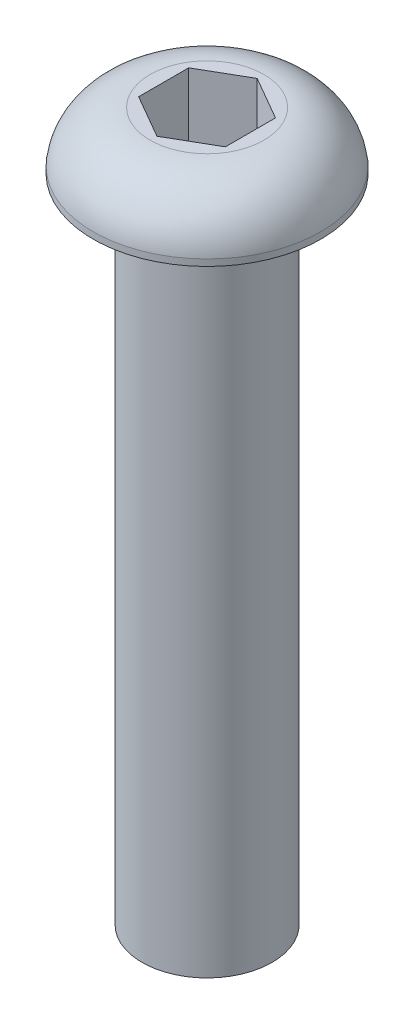
ISO-10303-21;
HEADER;
FILE_DESCRIPTION(('STEP AP214'),'2;1');
FILE_NAME('part.step','',(''),(''),'','','');
FILE_SCHEMA(('AUTOMOTIVE_DESIGN { 1 0 10303 214 1 1 1 1 }'));
ENDSEC;
DATA;
#1=APPLICATION_CONTEXT('core data for automotive mechanical design processes');
#2=APPLICATION_PROTOCOL_DEFINITION('international standard','automotive_design',2000,#1);
#3=PRODUCT_CONTEXT('',#1,'mechanical');
#4=PRODUCT('Part','Part','',(#3));
#5=PRODUCT_RELATED_PRODUCT_CATEGORY('part','',(#4));
#6=PRODUCT_DEFINITION_FORMATION('','',#4);
#7=PRODUCT_DEFINITION_CONTEXT('part definition',#1,'design');
#8=PRODUCT_DEFINITION('design','',#6,#7);
#9=PRODUCT_DEFINITION_SHAPE('','',#8);
#10=(LENGTH_UNIT() NAMED_UNIT(*) SI_UNIT(.MILLI.,.METRE.));
#11=(NAMED_UNIT(*) PLANE_ANGLE_UNIT() SI_UNIT($,.RADIAN.));
#12=(NAMED_UNIT(*) SI_UNIT($,.STERADIAN.) SOLID_ANGLE_UNIT());
#13=UNCERTAINTY_MEASURE_WITH_UNIT(LENGTH_MEASURE(1.E-05),#10,'distance_accuracy_value','');
#14=(GEOMETRIC_REPRESENTATION_CONTEXT(3) GLOBAL_UNCERTAINTY_ASSIGNED_CONTEXT((#13)) GLOBAL_UNIT_ASSIGNED_CONTEXT((#10,
#11,#12)) REPRESENTATION_CONTEXT('',''));
#15=CARTESIAN_POINT('',(0.,0.,0.));
#16=DIRECTION('',(0.,0.,1.));
#17=DIRECTION('',(1.,0.,0.));
#18=AXIS2_PLACEMENT_3D('',#15,#16,#17);
#19=CARTESIAN_POINT('',(0.,32.6420872430713,0.));
#20=DIRECTION('',(0.,1.,0.));
#21=DIRECTION('',(0.,0.,1.));
#22=AXIS2_PLACEMENT_3D('',#19,#20,#21);
#23=PLANE('',#22);
#24=DIRECTION('',(-0.866025403784438,0.,-0.5));
#25=VECTOR('',#24,1.);
#26=CARTESIAN_POINT('',(2.,32.6420872430713,-1.15470053837925));
#27=LINE('',#26,#25);
#28=CARTESIAN_POINT('',(2.,32.6420872430713,-1.15470053837925));
#29=VERTEX_POINT('',#28);
#30=CARTESIAN_POINT('',(0.,32.6420872430713,-2.3094010767585));
#31=VERTEX_POINT('',#30);
#32=EDGE_CURVE('E47',#29,#31,#27,.T.);
#33=ORIENTED_EDGE('',*,*,#32,.F.);
#34=DIRECTION('',(0.,0.,-1.));
#35=VECTOR('',#34,1.);
#36=CARTESIAN_POINT('',(2.,32.6420872430713,1.15470053837925));
#37=LINE('',#36,#35);
#38=CARTESIAN_POINT('',(2.,32.6420872430713,1.15470053837925));
#39=VERTEX_POINT('',#38);
#40=EDGE_CURVE('E130',#39,#29,#37,.T.);
#41=ORIENTED_EDGE('',*,*,#40,.F.);
#42=DIRECTION('',(0.866025403784438,0.,-0.5));
#43=VECTOR('',#42,1.);
#44=CARTESIAN_POINT('',(0.,32.6420872430713,2.3094010767585));
#45=LINE('',#44,#43);
#46=CARTESIAN_POINT('',(0.,32.6420872430713,2.3094010767585));
#47=VERTEX_POINT('',#46);
#48=EDGE_CURVE('E128',#47,#39,#45,.T.);
#49=ORIENTED_EDGE('',*,*,#48,.F.);
#50=DIRECTION('',(0.866025403784439,0.,0.5));
#51=VECTOR('',#50,1.);
#52=CARTESIAN_POINT('',(-2.,32.6420872430713,1.15470053837925));
#53=LINE('',#52,#51);
#54=CARTESIAN_POINT('',(-2.,32.6420872430713,1.15470053837925));
#55=VERTEX_POINT('',#54);
#56=EDGE_CURVE('E95',#55,#47,#53,.T.);
#57=ORIENTED_EDGE('',*,*,#56,.F.);
#58=DIRECTION('',(0.,0.,1.));
#59=VECTOR('',#58,1.);
#60=CARTESIAN_POINT('',(-2.,32.6420872430713,-1.15470053837925));
#61=LINE('',#60,#59);
#62=CARTESIAN_POINT('',(-2.,32.6420872430713,-1.15470053837925));
#63=VERTEX_POINT('',#62);
#64=EDGE_CURVE('E124',#63,#55,#61,.T.);
#65=ORIENTED_EDGE('',*,*,#64,.F.);
#66=DIRECTION('',(-0.866025403784438,0.,0.5));
#67=VECTOR('',#66,1.);
#68=CARTESIAN_POINT('',(0.,32.6420872430713,-2.3094010767585));
#69=LINE('',#68,#67);
#70=EDGE_CURVE('E121',#31,#63,#69,.T.);
#71=ORIENTED_EDGE('',*,*,#70,.F.);
#72=EDGE_LOOP('',(#33,#41,#49,#57,#65,#71));
#73=FACE_BOUND('',#72,.T.);
#74=CARTESIAN_POINT('',(0.,32.6420872430713,0.));
#75=DIRECTION('',(0.,-1.,0.));
#76=DIRECTION('',(0.,0.,-1.));
#77=AXIS2_PLACEMENT_3D('',#74,#75,#76);
#78=CIRCLE('',#77,2.625);
#79=CARTESIAN_POINT('',(0.,32.6420872430713,-2.625));
#80=VERTEX_POINT('',#79);
#81=EDGE_CURVE('E11',#80,#80,#78,.T.);
#82=ORIENTED_EDGE('',*,*,#81,.F.);
#83=EDGE_LOOP('',(#82));
#84=FACE_BOUND('',#83,.T.);
#85=ADVANCED_FACE('F33',(#73,#84),#23,.T.);
#86=CARTESIAN_POINT('',(0.,30.,0.));
#87=DIRECTION('',(0.,-1.,0.));
#88=DIRECTION('',(0.,0.,-1.));
#89=AXIS2_PLACEMENT_3D('',#86,#87,#88);
#90=DEGENERATE_TOROIDAL_SURFACE('',#89,2.625,2.64208724307128,.T.);
#91=ORIENTED_EDGE('',*,*,#81,.T.);
#92=EDGE_LOOP('',(#91));
#93=FACE_BOUND('',#92,.T.);
#94=CARTESIAN_POINT('',(0.,30.3,0.));
#95=DIRECTION('',(0.,-1.,0.));
#96=DIRECTION('',(0.,0.,-1.));
#97=AXIS2_PLACEMENT_3D('',#94,#95,#96);
#98=CIRCLE('',#97,5.25);
#99=CARTESIAN_POINT('',(0.,30.3,-5.25));
#100=VERTEX_POINT('',#99);
#101=EDGE_CURVE('E40',#100,#100,#98,.T.);
#102=ORIENTED_EDGE('',*,*,#101,.F.);
#103=EDGE_LOOP('',(#102));
#104=FACE_BOUND('',#103,.T.);
#105=ADVANCED_FACE('F153',(#93,#104),#90,.T.);
#106=CARTESIAN_POINT('',(0.,0.,0.));
#107=DIRECTION('',(0.,-1.,0.));
#108=DIRECTION('',(0.,0.,-1.));
#109=AXIS2_PLACEMENT_3D('',#106,#107,#108);
#110=CYLINDRICAL_SURFACE('',#109,5.25);
#111=ORIENTED_EDGE('',*,*,#101,.T.);
#112=EDGE_LOOP('',(#111));
#113=FACE_BOUND('',#112,.T.);
#114=CARTESIAN_POINT('',(0.,30.,0.));
#115=DIRECTION('',(0.,-1.,0.));
#116=DIRECTION('',(0.,0.,-1.));
#117=AXIS2_PLACEMENT_3D('',#114,#115,#116);
#118=CIRCLE('',#117,5.25);
#119=CARTESIAN_POINT('',(0.,30.,-5.25));
#120=VERTEX_POINT('',#119);
#121=EDGE_CURVE('E145',#120,#120,#118,.T.);
#122=ORIENTED_EDGE('',*,*,#121,.F.);
#123=EDGE_LOOP('',(#122));
#124=FACE_BOUND('',#123,.T.);
#125=ADVANCED_FACE('F150',(#113,#124),#110,.T.);
#126=CARTESIAN_POINT('',(5.25,30.,0.));
#127=DIRECTION('',(0.,-1.,0.));
#128=DIRECTION('',(0.,0.,-1.));
#129=AXIS2_PLACEMENT_3D('',#126,#127,#128);
#130=PLANE('',#129);
#131=ORIENTED_EDGE('',*,*,#121,.T.);
#132=EDGE_LOOP('',(#131));
#133=FACE_BOUND('',#132,.T.);
#134=CARTESIAN_POINT('',(0.,30.,0.));
#135=DIRECTION('',(0.,-1.,0.));
#136=DIRECTION('',(0.,0.,-1.));
#137=AXIS2_PLACEMENT_3D('',#134,#135,#136);
#138=CIRCLE('',#137,3.);
#139=CARTESIAN_POINT('',(0.,30.,-3.));
#140=VERTEX_POINT('',#139);
#141=EDGE_CURVE('E142',#140,#140,#138,.T.);
#142=ORIENTED_EDGE('',*,*,#141,.F.);
#143=EDGE_LOOP('',(#142));
#144=FACE_BOUND('',#143,.T.);
#145=ADVANCED_FACE('F160',(#133,#144),#130,.T.);
#146=CARTESIAN_POINT('',(0.,0.,0.));
#147=DIRECTION('',(0.,-1.,0.));
#148=DIRECTION('',(0.,0.,-1.));
#149=AXIS2_PLACEMENT_3D('',#146,#147,#148);
#150=CYLINDRICAL_SURFACE('',#149,3.);
#151=ORIENTED_EDGE('',*,*,#141,.T.);
#152=EDGE_LOOP('',(#151));
#153=FACE_BOUND('',#152,.T.);
#154=CARTESIAN_POINT('',(0.,0.,0.));
#155=DIRECTION('',(0.,-1.,0.));
#156=DIRECTION('',(0.,0.,-1.));
#157=AXIS2_PLACEMENT_3D('',#154,#155,#156);
#158=CIRCLE('',#157,3.);
#159=CARTESIAN_POINT('',(0.,0.,-3.));
#160=VERTEX_POINT('',#159);
#161=EDGE_CURVE('E134',#160,#160,#158,.T.);
#162=ORIENTED_EDGE('',*,*,#161,.F.);
#163=EDGE_LOOP('',(#162));
#164=FACE_BOUND('',#163,.T.);
#165=ADVANCED_FACE('F166',(#153,#164),#150,.T.);
#166=CARTESIAN_POINT('',(3.,0.,0.));
#167=DIRECTION('',(0.,-1.,0.));
#168=DIRECTION('',(0.,0.,-1.));
#169=AXIS2_PLACEMENT_3D('',#166,#167,#168);
#170=PLANE('',#169);
#171=ORIENTED_EDGE('',*,*,#161,.T.);
#172=EDGE_LOOP('',(#171));
#173=FACE_BOUND('',#172,.T.);
#174=ADVANCED_FACE('F170',(#173),#170,.T.);
#175=CARTESIAN_POINT('',(2.,27.6420872430713,-1.15470053837925));
#176=DIRECTION('',(0.5,0.,-0.866025403784439));
#177=DIRECTION('',(-0.866025403784439,0.,-0.5));
#178=AXIS2_PLACEMENT_3D('',#175,#176,#177);
#179=PLANE('',#178);
#180=ORIENTED_EDGE('',*,*,#32,.T.);
#181=DIRECTION('',(0.,1.,0.));
#182=VECTOR('',#181,1.);
#183=CARTESIAN_POINT('',(0.,27.6420872430713,-2.3094010767585));
#184=LINE('',#183,#182);
#185=CARTESIAN_POINT('',(0.,27.6420872430713,-2.3094010767585));
#186=VERTEX_POINT('',#185);
#187=EDGE_CURVE('E77',#186,#31,#184,.T.);
#188=ORIENTED_EDGE('',*,*,#187,.F.);
#189=DIRECTION('',(-0.866025403784438,0.,-0.5));
#190=VECTOR('',#189,1.);
#191=CARTESIAN_POINT('',(2.,27.6420872430713,-1.15470053837925));
#192=LINE('',#191,#190);
#193=CARTESIAN_POINT('',(2.,27.6420872430713,-1.15470053837925));
#194=VERTEX_POINT('',#193);
#195=EDGE_CURVE('E132',#194,#186,#192,.T.);
#196=ORIENTED_EDGE('',*,*,#195,.F.);
#197=DIRECTION('',(0.,1.,0.));
#198=VECTOR('',#197,1.);
#199=CARTESIAN_POINT('',(2.,27.6420872430713,-1.15470053837925));
#200=LINE('',#199,#198);
#201=EDGE_CURVE('E55',#194,#29,#200,.T.);
#202=ORIENTED_EDGE('',*,*,#201,.T.);
#203=EDGE_LOOP('',(#180,#188,#196,#202));
#204=FACE_BOUND('',#203,.T.);
#205=ADVANCED_FACE('F174',(#204),#179,.F.);
#206=CARTESIAN_POINT('',(2.,27.6420872430713,1.15470053837925));
#207=DIRECTION('',(1.,0.,0.));
#208=DIRECTION('',(0.,0.,-1.));
#209=AXIS2_PLACEMENT_3D('',#206,#207,#208);
#210=PLANE('',#209);
#211=ORIENTED_EDGE('',*,*,#40,.T.);
#212=ORIENTED_EDGE('',*,*,#201,.F.);
#213=DIRECTION('',(0.,0.,-1.));
#214=VECTOR('',#213,1.);
#215=CARTESIAN_POINT('',(2.,27.6420872430713,1.15470053837925));
#216=LINE('',#215,#214);
#217=CARTESIAN_POINT('',(2.,27.6420872430713,1.15470053837925));
#218=VERTEX_POINT('',#217);
#219=EDGE_CURVE('E107',#218,#194,#216,.T.);
#220=ORIENTED_EDGE('',*,*,#219,.F.);
#221=DIRECTION('',(0.,1.,0.));
#222=VECTOR('',#221,1.);
#223=CARTESIAN_POINT('',(2.,27.6420872430713,1.15470053837925));
#224=LINE('',#223,#222);
#225=EDGE_CURVE('E99',#218,#39,#224,.T.);
#226=ORIENTED_EDGE('',*,*,#225,.T.);
#227=EDGE_LOOP('',(#211,#212,#220,#226));
#228=FACE_BOUND('',#227,.T.);
#229=ADVANCED_FACE('F178',(#228),#210,.F.);
#230=CARTESIAN_POINT('',(0.,27.6420872430713,2.3094010767585));
#231=DIRECTION('',(0.5,0.,0.866025403784438));
#232=DIRECTION('',(0.866025403784439,0.,-0.5));
#233=AXIS2_PLACEMENT_3D('',#230,#231,#232);
#234=PLANE('',#233);
#235=ORIENTED_EDGE('',*,*,#48,.T.);
#236=ORIENTED_EDGE('',*,*,#225,.F.);
#237=DIRECTION('',(0.866025403784438,0.,-0.5));
#238=VECTOR('',#237,1.);
#239=CARTESIAN_POINT('',(0.,27.6420872430713,2.3094010767585));
#240=LINE('',#239,#238);
#241=CARTESIAN_POINT('',(0.,27.6420872430713,2.3094010767585));
#242=VERTEX_POINT('',#241);
#243=EDGE_CURVE('E103',#242,#218,#240,.T.);
#244=ORIENTED_EDGE('',*,*,#243,.F.);
#245=DIRECTION('',(0.,1.,0.));
#246=VECTOR('',#245,1.);
#247=CARTESIAN_POINT('',(0.,27.6420872430713,2.3094010767585));
#248=LINE('',#247,#246);
#249=EDGE_CURVE('E88',#242,#47,#248,.T.);
#250=ORIENTED_EDGE('',*,*,#249,.T.);
#251=EDGE_LOOP('',(#235,#236,#244,#250));
#252=FACE_BOUND('',#251,.T.);
#253=ADVANCED_FACE('F104',(#252),#234,.F.);
#254=CARTESIAN_POINT('',(-2.,27.6420872430713,1.15470053837925));
#255=DIRECTION('',(-0.5,0.,0.866025403784438));
#256=DIRECTION('',(0.866025403784439,0.,0.5));
#257=AXIS2_PLACEMENT_3D('',#254,#255,#256);
#258=PLANE('',#257);
#259=ORIENTED_EDGE('',*,*,#56,.T.);
#260=ORIENTED_EDGE('',*,*,#249,.F.);
#261=DIRECTION('',(0.866025403784439,0.,0.5));
#262=VECTOR('',#261,1.);
#263=CARTESIAN_POINT('',(-2.,27.6420872430713,1.15470053837925));
#264=LINE('',#263,#262);
#265=CARTESIAN_POINT('',(-2.,27.6420872430713,1.15470053837925));
#266=VERTEX_POINT('',#265);
#267=EDGE_CURVE('E92',#266,#242,#264,.T.);
#268=ORIENTED_EDGE('',*,*,#267,.F.);
#269=DIRECTION('',(0.,1.,0.));
#270=VECTOR('',#269,1.);
#271=CARTESIAN_POINT('',(-2.,27.6420872430713,1.15470053837925));
#272=LINE('',#271,#270);
#273=EDGE_CURVE('E100',#266,#55,#272,.T.);
#274=ORIENTED_EDGE('',*,*,#273,.T.);
#275=EDGE_LOOP('',(#259,#260,#268,#274));
#276=FACE_BOUND('',#275,.T.);
#277=ADVANCED_FACE('F90',(#276),#258,.F.);
#278=CARTESIAN_POINT('',(-2.,27.6420872430713,-1.15470053837925));
#279=DIRECTION('',(-1.,0.,0.));
#280=DIRECTION('',(0.,0.,1.));
#281=AXIS2_PLACEMENT_3D('',#278,#279,#280);
#282=PLANE('',#281);
#283=ORIENTED_EDGE('',*,*,#64,.T.);
#284=ORIENTED_EDGE('',*,*,#273,.F.);
#285=DIRECTION('',(0.,0.,1.));
#286=VECTOR('',#285,1.);
#287=CARTESIAN_POINT('',(-2.,27.6420872430713,-1.15470053837925));
#288=LINE('',#287,#286);
#289=CARTESIAN_POINT('',(-2.,27.6420872430713,-1.15470053837925));
#290=VERTEX_POINT('',#289);
#291=EDGE_CURVE('E113',#290,#266,#288,.T.);
#292=ORIENTED_EDGE('',*,*,#291,.F.);
#293=DIRECTION('',(0.,1.,0.));
#294=VECTOR('',#293,1.);
#295=CARTESIAN_POINT('',(-2.,27.6420872430713,-1.15470053837925));
#296=LINE('',#295,#294);
#297=EDGE_CURVE('E137',#290,#63,#296,.T.);
#298=ORIENTED_EDGE('',*,*,#297,.T.);
#299=EDGE_LOOP('',(#283,#284,#292,#298));
#300=FACE_BOUND('',#299,.T.);
#301=ADVANCED_FACE('F182',(#300),#282,.F.);
#302=CARTESIAN_POINT('',(0.,27.6420872430713,-2.3094010767585));
#303=DIRECTION('',(-0.5,0.,-0.866025403784438));
#304=DIRECTION('',(-0.866025403784439,0.,0.5));
#305=AXIS2_PLACEMENT_3D('',#302,#303,#304);
#306=PLANE('',#305);
#307=ORIENTED_EDGE('',*,*,#70,.T.);
#308=ORIENTED_EDGE('',*,*,#297,.F.);
#309=DIRECTION('',(-0.866025403784438,0.,0.5));
#310=VECTOR('',#309,1.);
#311=CARTESIAN_POINT('',(0.,27.6420872430713,-2.3094010767585));
#312=LINE('',#311,#310);
#313=EDGE_CURVE('E115',#186,#290,#312,.T.);
#314=ORIENTED_EDGE('',*,*,#313,.F.);
#315=ORIENTED_EDGE('',*,*,#187,.T.);
#316=EDGE_LOOP('',(#307,#308,#314,#315));
#317=FACE_BOUND('',#316,.T.);
#318=ADVANCED_FACE('F179',(#317),#306,.F.);
#319=CARTESIAN_POINT('',(0.,27.6420872430713,0.));
#320=DIRECTION('',(0.,1.,0.));
#321=DIRECTION('',(0.,0.,1.));
#322=AXIS2_PLACEMENT_3D('',#319,#320,#321);
#323=PLANE('',#322);
#324=ORIENTED_EDGE('',*,*,#195,.T.);
#325=ORIENTED_EDGE('',*,*,#313,.T.);
#326=ORIENTED_EDGE('',*,*,#291,.T.);
#327=ORIENTED_EDGE('',*,*,#267,.T.);
#328=ORIENTED_EDGE('',*,*,#243,.T.);
#329=ORIENTED_EDGE('',*,*,#219,.T.);
#330=EDGE_LOOP('',(#324,#325,#326,#327,#328,#329));
#331=FACE_BOUND('',#330,.T.);
#332=ADVANCED_FACE('F110',(#331),#323,.T.);
#333=CLOSED_SHELL('',(#85,#105,#125,#145,#165,#174,#205,#229,#253,#277,#301,#318,#332));
#334=MANIFOLD_SOLID_BREP('B2',#333);
#335=ADVANCED_BREP_SHAPE_REPRESENTATION('',(#18,#334),#14);
#336=SHAPE_DEFINITION_REPRESENTATION(#9,#335);
ENDSEC;
END-ISO-10303-21;
